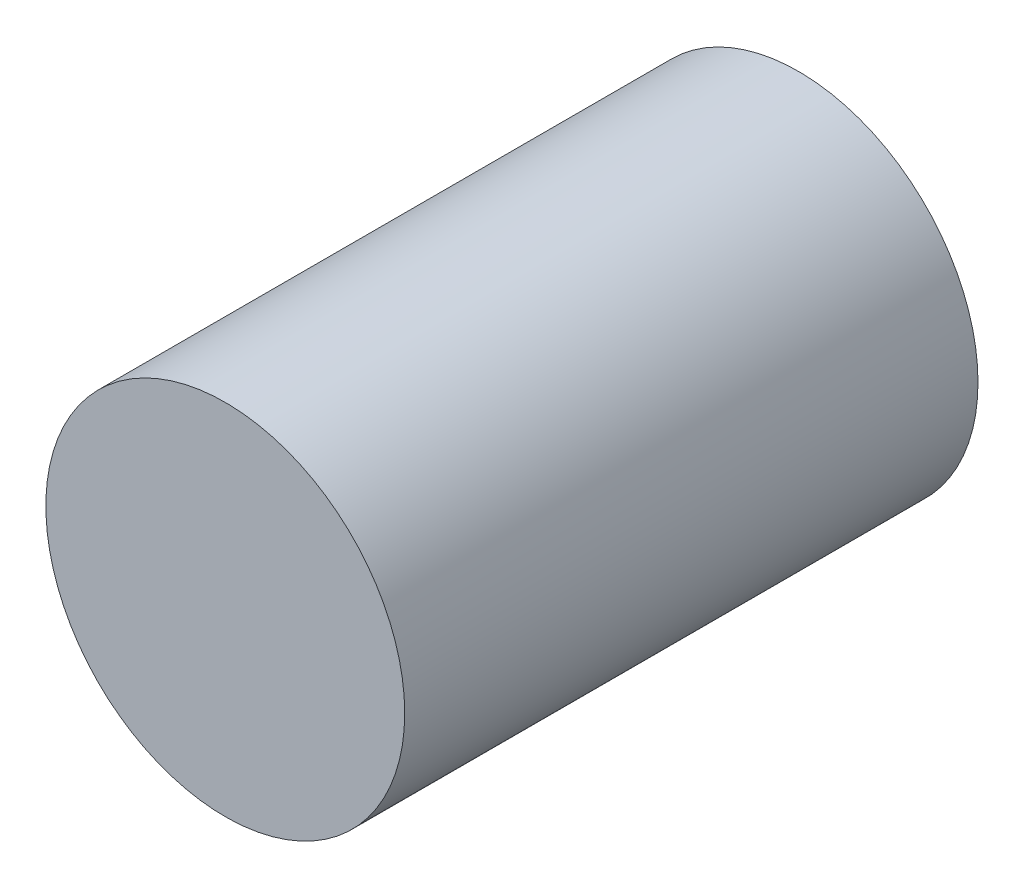
ISO-10303-21;
HEADER;
FILE_DESCRIPTION(('STEP AP214'),'2;1');
FILE_NAME('part.step','',(''),(''),'','','');
FILE_SCHEMA(('AUTOMOTIVE_DESIGN { 1 0 10303 214 1 1 1 1 }'));
ENDSEC;
DATA;
#1=APPLICATION_CONTEXT('core data for automotive mechanical design processes');
#2=APPLICATION_PROTOCOL_DEFINITION('international standard','automotive_design',2000,#1);
#3=PRODUCT_CONTEXT('',#1,'mechanical');
#4=PRODUCT('Part','Part','',(#3));
#5=PRODUCT_RELATED_PRODUCT_CATEGORY('part','',(#4));
#6=PRODUCT_DEFINITION_FORMATION('','',#4);
#7=PRODUCT_DEFINITION_CONTEXT('part definition',#1,'design');
#8=PRODUCT_DEFINITION('design','',#6,#7);
#9=PRODUCT_DEFINITION_SHAPE('','',#8);
#10=(LENGTH_UNIT() NAMED_UNIT(*) SI_UNIT(.MILLI.,.METRE.));
#11=(NAMED_UNIT(*) PLANE_ANGLE_UNIT() SI_UNIT($,.RADIAN.));
#12=(NAMED_UNIT(*) SI_UNIT($,.STERADIAN.) SOLID_ANGLE_UNIT());
#13=UNCERTAINTY_MEASURE_WITH_UNIT(LENGTH_MEASURE(1.E-05),#10,'distance_accuracy_value','');
#14=(GEOMETRIC_REPRESENTATION_CONTEXT(3) GLOBAL_UNCERTAINTY_ASSIGNED_CONTEXT((#13)) GLOBAL_UNIT_ASSIGNED_CONTEXT((#10,
#11,#12)) REPRESENTATION_CONTEXT('',''));
#15=CARTESIAN_POINT('',(0.,0.,0.));
#16=DIRECTION('',(0.,0.,1.));
#17=DIRECTION('',(1.,0.,0.));
#18=AXIS2_PLACEMENT_3D('',#15,#16,#17);
#19=CARTESIAN_POINT('',(0.,0.,50.8));
#20=DIRECTION('',(0.,0.,-1.));
#21=DIRECTION('',(-1.,0.,0.));
#22=AXIS2_PLACEMENT_3D('',#19,#20,#21);
#23=CYLINDRICAL_SURFACE('',#22,15.9);
#24=CARTESIAN_POINT('',(0.,0.,50.8));
#25=DIRECTION('',(0.,0.,1.));
#26=DIRECTION('',(1.,0.,0.));
#27=AXIS2_PLACEMENT_3D('',#24,#25,#26);
#28=CIRCLE('',#27,15.9);
#29=CARTESIAN_POINT('',(15.9,0.,50.8));
#30=VERTEX_POINT('',#29);
#31=EDGE_CURVE('E10',#30,#30,#28,.T.);
#32=ORIENTED_EDGE('',*,*,#31,.F.);
#33=EDGE_LOOP('',(#32));
#34=FACE_BOUND('',#33,.T.);
#35=CARTESIAN_POINT('',(0.,0.,0.));
#36=DIRECTION('',(0.,0.,1.));
#37=DIRECTION('',(1.,0.,0.));
#38=AXIS2_PLACEMENT_3D('',#35,#36,#37);
#39=CIRCLE('',#38,15.9);
#40=CARTESIAN_POINT('',(15.9,0.,0.));
#41=VERTEX_POINT('',#40);
#42=EDGE_CURVE('E32',#41,#41,#39,.T.);
#43=ORIENTED_EDGE('',*,*,#42,.T.);
#44=EDGE_LOOP('',(#43));
#45=FACE_BOUND('',#44,.T.);
#46=ADVANCED_FACE('F29',(#34,#45),#23,.T.);
#47=CARTESIAN_POINT('',(0.,0.,50.8));
#48=DIRECTION('',(0.,0.,1.));
#49=DIRECTION('',(1.,0.,0.));
#50=AXIS2_PLACEMENT_3D('',#47,#48,#49);
#51=PLANE('',#50);
#52=ORIENTED_EDGE('',*,*,#31,.T.);
#53=EDGE_LOOP('',(#52));
#54=FACE_BOUND('',#53,.T.);
#55=ADVANCED_FACE('F44',(#54),#51,.T.);
#56=CARTESIAN_POINT('',(0.,0.,0.));
#57=DIRECTION('',(0.,0.,1.));
#58=DIRECTION('',(1.,0.,0.));
#59=AXIS2_PLACEMENT_3D('',#56,#57,#58);
#60=PLANE('',#59);
#61=ORIENTED_EDGE('',*,*,#42,.F.);
#62=EDGE_LOOP('',(#61));
#63=FACE_BOUND('',#62,.T.);
#64=ADVANCED_FACE('F42',(#63),#60,.F.);
#65=CLOSED_SHELL('',(#46,#55,#64));
#66=MANIFOLD_SOLID_BREP('B2',#65);
#67=ADVANCED_BREP_SHAPE_REPRESENTATION('',(#18,#66),#14);
#68=SHAPE_DEFINITION_REPRESENTATION(#9,#67);
ENDSEC;
END-ISO-10303-21;
